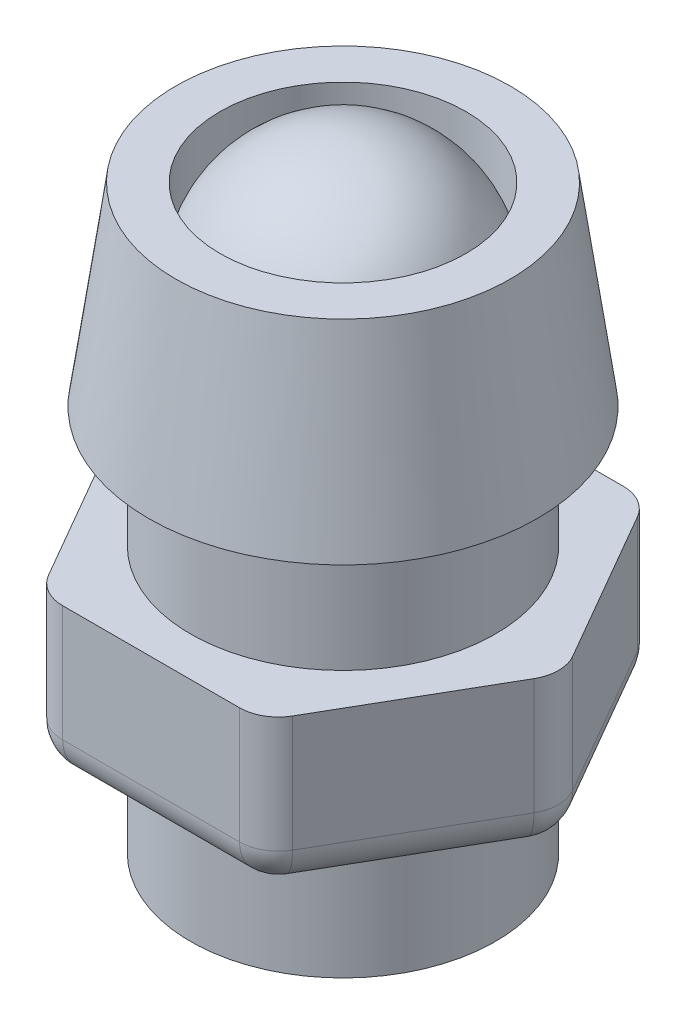
ISO-10303-21;
HEADER;
FILE_DESCRIPTION(('STEP AP214'),'2;1');
FILE_NAME('part.step','',(''),(''),'','','');
FILE_SCHEMA(('AUTOMOTIVE_DESIGN { 1 0 10303 214 1 1 1 1 }'));
ENDSEC;
DATA;
#1=APPLICATION_CONTEXT('core data for automotive mechanical design processes');
#2=APPLICATION_PROTOCOL_DEFINITION('international standard','automotive_design',2000,#1);
#3=PRODUCT_CONTEXT('',#1,'mechanical');
#4=PRODUCT('Part','Part','',(#3));
#5=PRODUCT_RELATED_PRODUCT_CATEGORY('part','',(#4));
#6=PRODUCT_DEFINITION_FORMATION('','',#4);
#7=PRODUCT_DEFINITION_CONTEXT('part definition',#1,'design');
#8=PRODUCT_DEFINITION('design','',#6,#7);
#9=PRODUCT_DEFINITION_SHAPE('','',#8);
#10=(LENGTH_UNIT() NAMED_UNIT(*) SI_UNIT(.MILLI.,.METRE.));
#11=(NAMED_UNIT(*) PLANE_ANGLE_UNIT() SI_UNIT($,.RADIAN.));
#12=(NAMED_UNIT(*) SI_UNIT($,.STERADIAN.) SOLID_ANGLE_UNIT());
#13=UNCERTAINTY_MEASURE_WITH_UNIT(LENGTH_MEASURE(1.E-05),#10,'distance_accuracy_value','');
#14=(GEOMETRIC_REPRESENTATION_CONTEXT(3) GLOBAL_UNCERTAINTY_ASSIGNED_CONTEXT((#13)) GLOBAL_UNIT_ASSIGNED_CONTEXT((#10,
#11,#12)) REPRESENTATION_CONTEXT('',''));
#15=CARTESIAN_POINT('',(0.,0.,0.));
#16=DIRECTION('',(0.,0.,1.));
#17=DIRECTION('',(1.,0.,0.));
#18=AXIS2_PLACEMENT_3D('',#15,#16,#17);
#19=CARTESIAN_POINT('',(0.,12.7,0.));
#20=DIRECTION('',(0.,-1.,0.));
#21=DIRECTION('',(1.,0.,0.));
#22=AXIS2_PLACEMENT_3D('',#19,#20,#21);
#23=SPHERICAL_SURFACE('',#22,3.3);
#24=CARTESIAN_POINT('',(0.,13.5996527107723,0.));
#25=DIRECTION('',(0.,-1.,0.));
#26=DIRECTION('',(0.,0.,-1.));
#27=AXIS2_PLACEMENT_3D('',#24,#25,#26);
#28=CIRCLE('',#27,3.175);
#29=CARTESIAN_POINT('',(0.,13.5996527107723,-3.175));
#30=VERTEX_POINT('',#29);
#31=EDGE_CURVE('E11',#30,#30,#28,.T.);
#32=ORIENTED_EDGE('',*,*,#31,.F.);
#33=EDGE_LOOP('',(#32));
#34=FACE_BOUND('',#33,.T.);
#35=ADVANCED_FACE('F44',(#34),#23,.T.);
#36=CARTESIAN_POINT('',(0.,13.5996527107723,0.));
#37=DIRECTION('',(0.,-1.,0.));
#38=DIRECTION('',(0.,0.,-1.));
#39=AXIS2_PLACEMENT_3D('',#36,#37,#38);
#40=PLANE('',#39);
#41=ORIENTED_EDGE('',*,*,#31,.T.);
#42=EDGE_LOOP('',(#41));
#43=FACE_BOUND('',#42,.T.);
#44=ADVANCED_FACE('F51',(#43),#40,.T.);
#45=CLOSED_SHELL('',(#35,#44));
#46=MANIFOLD_SOLID_BREP('B2',#45);
#47=CARTESIAN_POINT('',(0.,0.,0.));
#48=DIRECTION('',(0.,-1.,0.));
#49=DIRECTION('',(0.,0.,-1.));
#50=AXIS2_PLACEMENT_3D('',#47,#48,#49);
#51=CYLINDRICAL_SURFACE('',#50,3.937);
#52=CARTESIAN_POINT('',(0.,9.99999999999999,0.));
#53=DIRECTION('',(0.,-1.,0.));
#54=DIRECTION('',(0.,0.,-1.));
#55=AXIS2_PLACEMENT_3D('',#52,#53,#54);
#56=CIRCLE('',#55,3.937);
#57=CARTESIAN_POINT('',(0.,9.99999999999999,-3.937));
#58=VERTEX_POINT('',#57);
#59=EDGE_CURVE('E233',#58,#58,#56,.T.);
#60=ORIENTED_EDGE('',*,*,#59,.T.);
#61=EDGE_LOOP('',(#60));
#62=FACE_BOUND('',#61,.T.);
#63=CARTESIAN_POINT('',(0.,6.87499999999999,0.));
#64=DIRECTION('',(0.,-1.,0.));
#65=DIRECTION('',(0.,0.,-1.));
#66=AXIS2_PLACEMENT_3D('',#63,#64,#65);
#67=CIRCLE('',#66,3.937);
#68=CARTESIAN_POINT('',(0.,6.87499999999999,-3.937));
#69=VERTEX_POINT('',#68);
#70=EDGE_CURVE('E211',#69,#69,#67,.F.);
#71=ORIENTED_EDGE('',*,*,#70,.T.);
#72=EDGE_LOOP('',(#71));
#73=FACE_BOUND('',#72,.T.);
#74=ADVANCED_FACE('F71',(#62,#73),#51,.T.);
#75=CARTESIAN_POINT('',(0.,0.,0.));
#76=DIRECTION('',(0.,1.,0.));
#77=DIRECTION('',(0.,0.,1.));
#78=AXIS2_PLACEMENT_3D('',#75,#76,#77);
#79=CYLINDRICAL_SURFACE('',#78,3.175);
#80=CARTESIAN_POINT('',(0.,15.,0.));
#81=DIRECTION('',(0.,1.,0.));
#82=DIRECTION('',(0.,0.,1.));
#83=AXIS2_PLACEMENT_3D('',#80,#81,#82);
#84=CIRCLE('',#83,3.175);
#85=CARTESIAN_POINT('',(0.,15.,3.175));
#86=VERTEX_POINT('',#85);
#87=EDGE_CURVE('E228',#86,#86,#84,.T.);
#88=ORIENTED_EDGE('',*,*,#87,.T.);
#89=EDGE_LOOP('',(#88));
#90=FACE_BOUND('',#89,.T.);
#91=CARTESIAN_POINT('',(0.,6.87499999999999,0.));
#92=DIRECTION('',(0.,-1.,0.));
#93=DIRECTION('',(0.,0.,-1.));
#94=AXIS2_PLACEMENT_3D('',#91,#92,#93);
#95=CIRCLE('',#94,3.175);
#96=CARTESIAN_POINT('',(0.,6.87499999999999,-3.175));
#97=VERTEX_POINT('',#96);
#98=EDGE_CURVE('E223',#97,#97,#95,.F.);
#99=ORIENTED_EDGE('',*,*,#98,.F.);
#100=EDGE_LOOP('',(#99));
#101=FACE_BOUND('',#100,.T.);
#102=ADVANCED_FACE('F451',(#90,#101),#79,.F.);
#103=CARTESIAN_POINT('',(0.,15.,0.));
#104=DIRECTION('',(0.,1.,0.));
#105=DIRECTION('',(0.,0.,1.));
#106=AXIS2_PLACEMENT_3D('',#103,#104,#105);
#107=PLANE('',#106);
#108=ORIENTED_EDGE('',*,*,#87,.F.);
#109=EDGE_LOOP('',(#108));
#110=FACE_BOUND('',#109,.T.);
#111=CARTESIAN_POINT('',(0.,15.,0.));
#112=DIRECTION('',(0.,-1.,0.));
#113=DIRECTION('',(0.,0.,-1.));
#114=AXIS2_PLACEMENT_3D('',#111,#112,#113);
#115=CIRCLE('',#114,4.318);
#116=CARTESIAN_POINT('',(0.,15.,-4.318));
#117=VERTEX_POINT('',#116);
#118=EDGE_CURVE('E239',#117,#117,#115,.T.);
#119=ORIENTED_EDGE('',*,*,#118,.F.);
#120=EDGE_LOOP('',(#119));
#121=FACE_BOUND('',#120,.T.);
#122=ADVANCED_FACE('F459',(#110,#121),#107,.T.);
#123=CARTESIAN_POINT('',(0.,10.,0.));
#124=DIRECTION('',(0.,-1.,0.));
#125=DIRECTION('',(0.,0.,-1.));
#126=AXIS2_PLACEMENT_3D('',#123,#124,#125);
#127=CONICAL_SURFACE('',#126,5.02070417351192,0.139626340159539);
#128=ORIENTED_EDGE('',*,*,#118,.T.);
#129=EDGE_LOOP('',(#128));
#130=FACE_BOUND('',#129,.T.);
#131=CARTESIAN_POINT('',(0.,10.,0.));
#132=DIRECTION('',(0.,-1.,0.));
#133=DIRECTION('',(0.,0.,-1.));
#134=AXIS2_PLACEMENT_3D('',#131,#132,#133);
#135=CIRCLE('',#134,5.02070417351192);
#136=CARTESIAN_POINT('',(0.,10.,-5.02070417351192));
#137=VERTEX_POINT('',#136);
#138=EDGE_CURVE('E236',#137,#137,#135,.T.);
#139=ORIENTED_EDGE('',*,*,#138,.F.);
#140=EDGE_LOOP('',(#139));
#141=FACE_BOUND('',#140,.T.);
#142=ADVANCED_FACE('F468',(#130,#141),#127,.T.);
#143=CARTESIAN_POINT('',(5.02070417351192,9.99999999999999,0.));
#144=DIRECTION('',(0.,-1.,0.));
#145=DIRECTION('',(0.,0.,-1.));
#146=AXIS2_PLACEMENT_3D('',#143,#144,#145);
#147=PLANE('',#146);
#148=ORIENTED_EDGE('',*,*,#138,.T.);
#149=EDGE_LOOP('',(#148));
#150=FACE_BOUND('',#149,.T.);
#151=ORIENTED_EDGE('',*,*,#59,.F.);
#152=EDGE_LOOP('',(#151));
#153=FACE_BOUND('',#152,.T.);
#154=ADVANCED_FACE('F464',(#150,#153),#147,.T.);
#155=CARTESIAN_POINT('',(0.,6.87499999999999,0.));
#156=DIRECTION('',(0.,-1.,0.));
#157=DIRECTION('',(0.,0.,-1.));
#158=AXIS2_PLACEMENT_3D('',#155,#156,#157);
#159=PLANE('',#158);
#160=ORIENTED_EDGE('',*,*,#98,.T.);
#161=EDGE_LOOP('',(#160));
#162=FACE_BOUND('',#161,.T.);
#163=ADVANCED_FACE('F467',(#162),#159,.F.);
#164=CARTESIAN_POINT('',(-2.85961588329622,2.87499999999999,4.953));
#165=DIRECTION('',(0.866025403784439,0.,-0.5));
#166=DIRECTION('',(-0.5,0.,-0.866025403784439));
#167=AXIS2_PLACEMENT_3D('',#164,#165,#166);
#168=PLANE('',#167);
#169=DIRECTION('',(0.,1.,0.));
#170=VECTOR('',#169,1.);
#171=CARTESIAN_POINT('',(-5.43055663199762,2.87499999999999,0.5));
#172=LINE('',#171,#170);
#173=CARTESIAN_POINT('',(-5.43055663199762,6.87499999999999,0.5));
#174=VERTEX_POINT('',#173);
#175=CARTESIAN_POINT('',(-5.43055663199762,3.87499999999999,0.5));
#176=VERTEX_POINT('',#175);
#177=EDGE_CURVE('E268',#174,#176,#172,.F.);
#178=ORIENTED_EDGE('',*,*,#177,.T.);
#179=DIRECTION('',(-0.5,0.,-0.866025403784439));
#180=VECTOR('',#179,1.);
#181=CARTESIAN_POINT('',(-3.14829101789103,3.87499999999999,4.453));
#182=LINE('',#181,#180);
#183=CARTESIAN_POINT('',(-3.14829101789103,3.87499999999999,4.453));
#184=VERTEX_POINT('',#183);
#185=EDGE_CURVE('E296',#176,#184,#182,.F.);
#186=ORIENTED_EDGE('',*,*,#185,.T.);
#187=DIRECTION('',(0.,1.,0.));
#188=VECTOR('',#187,1.);
#189=CARTESIAN_POINT('',(-3.14829101789103,2.87499999999999,4.453));
#190=LINE('',#189,#188);
#191=CARTESIAN_POINT('',(-3.14829101789103,6.87499999999999,4.453));
#192=VERTEX_POINT('',#191);
#193=EDGE_CURVE('E266',#184,#192,#190,.T.);
#194=ORIENTED_EDGE('',*,*,#193,.T.);
#195=DIRECTION('',(-0.5,0.,-0.866025403784439));
#196=VECTOR('',#195,1.);
#197=CARTESIAN_POINT('',(-2.85961588329622,6.87499999999999,4.953));
#198=LINE('',#197,#196);
#199=EDGE_CURVE('E343',#192,#174,#198,.T.);
#200=ORIENTED_EDGE('',*,*,#199,.T.);
#201=EDGE_LOOP('',(#178,#186,#194,#200));
#202=FACE_BOUND('',#201,.T.);
#203=ADVANCED_FACE('F409',(#202),#168,.F.);
#204=CARTESIAN_POINT('',(-5.71923176659243,2.87499999999999,0.));
#205=DIRECTION('',(0.866025403784438,0.,0.5));
#206=DIRECTION('',(0.5,0.,-0.866025403784439));
#207=AXIS2_PLACEMENT_3D('',#204,#205,#206);
#208=PLANE('',#207);
#209=DIRECTION('',(0.,1.,0.));
#210=VECTOR('',#209,1.);
#211=CARTESIAN_POINT('',(-3.14829101789103,2.87499999999999,-4.453));
#212=LINE('',#211,#210);
#213=CARTESIAN_POINT('',(-3.14829101789103,6.87499999999999,-4.453));
#214=VERTEX_POINT('',#213);
#215=CARTESIAN_POINT('',(-3.14829101789103,3.87499999999999,-4.453));
#216=VERTEX_POINT('',#215);
#217=EDGE_CURVE('E263',#214,#216,#212,.F.);
#218=ORIENTED_EDGE('',*,*,#217,.T.);
#219=DIRECTION('',(0.5,0.,-0.866025403784439));
#220=VECTOR('',#219,1.);
#221=CARTESIAN_POINT('',(-5.43055663199762,3.87499999999999,-0.499999999999999));
#222=LINE('',#221,#220);
#223=CARTESIAN_POINT('',(-5.43055663199762,3.87499999999999,-0.5));
#224=VERTEX_POINT('',#223);
#225=EDGE_CURVE('E292',#216,#224,#222,.F.);
#226=ORIENTED_EDGE('',*,*,#225,.T.);
#227=DIRECTION('',(0.,1.,0.));
#228=VECTOR('',#227,1.);
#229=CARTESIAN_POINT('',(-5.43055663199762,2.87499999999999,-0.5));
#230=LINE('',#229,#228);
#231=CARTESIAN_POINT('',(-5.43055663199762,6.87499999999999,-0.5));
#232=VERTEX_POINT('',#231);
#233=EDGE_CURVE('E261',#224,#232,#230,.T.);
#234=ORIENTED_EDGE('',*,*,#233,.T.);
#235=DIRECTION('',(0.5,0.,-0.866025403784439));
#236=VECTOR('',#235,1.);
#237=CARTESIAN_POINT('',(-5.71923176659243,6.87499999999999,0.));
#238=LINE('',#237,#236);
#239=EDGE_CURVE('E348',#232,#214,#238,.T.);
#240=ORIENTED_EDGE('',*,*,#239,.T.);
#241=EDGE_LOOP('',(#218,#226,#234,#240));
#242=FACE_BOUND('',#241,.T.);
#243=ADVANCED_FACE('F394',(#242),#208,.F.);
#244=CARTESIAN_POINT('',(-2.85961588329621,2.87499999999999,-4.953));
#245=DIRECTION('',(0.,0.,1.));
#246=DIRECTION('',(1.,0.,0.));
#247=AXIS2_PLACEMENT_3D('',#244,#245,#246);
#248=PLANE('',#247);
#249=DIRECTION('',(0.,1.,0.));
#250=VECTOR('',#249,1.);
#251=CARTESIAN_POINT('',(2.28226561410659,2.87499999999999,-4.953));
#252=LINE('',#251,#250);
#253=CARTESIAN_POINT('',(2.28226561410659,6.87499999999999,-4.953));
#254=VERTEX_POINT('',#253);
#255=CARTESIAN_POINT('',(2.28226561410659,3.87499999999999,-4.953));
#256=VERTEX_POINT('',#255);
#257=EDGE_CURVE('E259',#254,#256,#252,.F.);
#258=ORIENTED_EDGE('',*,*,#257,.T.);
#259=DIRECTION('',(1.,0.,0.));
#260=VECTOR('',#259,1.);
#261=CARTESIAN_POINT('',(-2.28226561410659,3.87499999999999,-4.953));
#262=LINE('',#261,#260);
#263=CARTESIAN_POINT('',(-2.28226561410659,3.87499999999999,-4.953));
#264=VERTEX_POINT('',#263);
#265=EDGE_CURVE('E42',#256,#264,#262,.F.);
#266=ORIENTED_EDGE('',*,*,#265,.T.);
#267=DIRECTION('',(0.,1.,0.));
#268=VECTOR('',#267,1.);
#269=CARTESIAN_POINT('',(-2.28226561410659,2.87499999999999,-4.953));
#270=LINE('',#269,#268);
#271=CARTESIAN_POINT('',(-2.28226561410659,6.87499999999999,-4.953));
#272=VERTEX_POINT('',#271);
#273=EDGE_CURVE('E257',#264,#272,#270,.T.);
#274=ORIENTED_EDGE('',*,*,#273,.T.);
#275=DIRECTION('',(1.,0.,0.));
#276=VECTOR('',#275,1.);
#277=CARTESIAN_POINT('',(-2.85961588329621,6.87499999999999,-4.953));
#278=LINE('',#277,#276);
#279=EDGE_CURVE('E213',#272,#254,#278,.T.);
#280=ORIENTED_EDGE('',*,*,#279,.T.);
#281=EDGE_LOOP('',(#258,#266,#274,#280));
#282=FACE_BOUND('',#281,.T.);
#283=ADVANCED_FACE('F358',(#282),#248,.F.);
#284=CARTESIAN_POINT('',(2.85961588329622,2.87499999999999,-4.953));
#285=DIRECTION('',(-0.866025403784439,0.,0.5));
#286=DIRECTION('',(0.5,0.,0.866025403784439));
#287=AXIS2_PLACEMENT_3D('',#284,#285,#286);
#288=PLANE('',#287);
#289=DIRECTION('',(0.,1.,0.));
#290=VECTOR('',#289,1.);
#291=CARTESIAN_POINT('',(5.43055663199762,2.87499999999999,-0.499999999999999));
#292=LINE('',#291,#290);
#293=CARTESIAN_POINT('',(5.43055663199762,6.87499999999999,-0.499999999999999));
#294=VERTEX_POINT('',#293);
#295=CARTESIAN_POINT('',(5.43055663199762,3.87499999999999,-0.499999999999999));
#296=VERTEX_POINT('',#295);
#297=EDGE_CURVE('E197',#294,#296,#292,.F.);
#298=ORIENTED_EDGE('',*,*,#297,.T.);
#299=DIRECTION('',(0.5,0.,0.866025403784439));
#300=VECTOR('',#299,1.);
#301=CARTESIAN_POINT('',(3.14829101789103,3.87499999999999,-4.453));
#302=LINE('',#301,#300);
#303=CARTESIAN_POINT('',(3.14829101789103,3.87499999999999,-4.453));
#304=VERTEX_POINT('',#303);
#305=EDGE_CURVE('E95',#296,#304,#302,.F.);
#306=ORIENTED_EDGE('',*,*,#305,.T.);
#307=DIRECTION('',(0.,1.,0.));
#308=VECTOR('',#307,1.);
#309=CARTESIAN_POINT('',(3.14829101789103,2.87499999999999,-4.453));
#310=LINE('',#309,#308);
#311=CARTESIAN_POINT('',(3.14829101789103,6.87499999999999,-4.453));
#312=VERTEX_POINT('',#311);
#313=EDGE_CURVE('E201',#304,#312,#310,.T.);
#314=ORIENTED_EDGE('',*,*,#313,.T.);
#315=DIRECTION('',(0.5,0.,0.866025403784439));
#316=VECTOR('',#315,1.);
#317=CARTESIAN_POINT('',(2.85961588329622,6.87499999999999,-4.953));
#318=LINE('',#317,#316);
#319=EDGE_CURVE('E208',#312,#294,#318,.T.);
#320=ORIENTED_EDGE('',*,*,#319,.T.);
#321=EDGE_LOOP('',(#298,#306,#314,#320));
#322=FACE_BOUND('',#321,.T.);
#323=ADVANCED_FACE('F365',(#322),#288,.F.);
#324=CARTESIAN_POINT('',(5.71923176659243,2.87499999999999,0.));
#325=DIRECTION('',(-0.866025403784438,0.,-0.5));
#326=DIRECTION('',(-0.5,0.,0.866025403784438));
#327=AXIS2_PLACEMENT_3D('',#324,#325,#326);
#328=PLANE('',#327);
#329=DIRECTION('',(0.,1.,0.));
#330=VECTOR('',#329,1.);
#331=CARTESIAN_POINT('',(3.14829101789103,2.87499999999999,4.453));
#332=LINE('',#331,#330);
#333=CARTESIAN_POINT('',(3.14829101789103,6.87499999999999,4.453));
#334=VERTEX_POINT('',#333);
#335=CARTESIAN_POINT('',(3.14829101789103,3.87499999999999,4.453));
#336=VERTEX_POINT('',#335);
#337=EDGE_CURVE('E192',#334,#336,#332,.F.);
#338=ORIENTED_EDGE('',*,*,#337,.T.);
#339=DIRECTION('',(-0.5,0.,0.866025403784438));
#340=VECTOR('',#339,1.);
#341=CARTESIAN_POINT('',(5.43055663199762,3.87499999999999,0.500000000000001));
#342=LINE('',#341,#340);
#343=CARTESIAN_POINT('',(5.43055663199762,3.87499999999999,0.500000000000001));
#344=VERTEX_POINT('',#343);
#345=EDGE_CURVE('E188',#336,#344,#342,.F.);
#346=ORIENTED_EDGE('',*,*,#345,.T.);
#347=DIRECTION('',(0.,1.,0.));
#348=VECTOR('',#347,1.);
#349=CARTESIAN_POINT('',(5.43055663199762,2.87499999999999,0.500000000000001));
#350=LINE('',#349,#348);
#351=CARTESIAN_POINT('',(5.43055663199762,6.87499999999999,0.500000000000001));
#352=VERTEX_POINT('',#351);
#353=EDGE_CURVE('E180',#344,#352,#350,.T.);
#354=ORIENTED_EDGE('',*,*,#353,.T.);
#355=DIRECTION('',(-0.5,0.,0.866025403784438));
#356=VECTOR('',#355,1.);
#357=CARTESIAN_POINT('',(5.71923176659243,6.87499999999999,0.));
#358=LINE('',#357,#356);
#359=EDGE_CURVE('E185',#352,#334,#358,.T.);
#360=ORIENTED_EDGE('',*,*,#359,.T.);
#361=EDGE_LOOP('',(#338,#346,#354,#360));
#362=FACE_BOUND('',#361,.T.);
#363=ADVANCED_FACE('F183',(#362),#328,.F.);
#364=CARTESIAN_POINT('',(2.85961588329622,2.87499999999999,4.953));
#365=DIRECTION('',(0.,0.,-1.));
#366=DIRECTION('',(-1.,0.,0.));
#367=AXIS2_PLACEMENT_3D('',#364,#365,#366);
#368=PLANE('',#367);
#369=DIRECTION('',(0.,1.,0.));
#370=VECTOR('',#369,1.);
#371=CARTESIAN_POINT('',(-2.28226561410659,2.87499999999999,4.953));
#372=LINE('',#371,#370);
#373=CARTESIAN_POINT('',(-2.28226561410659,6.87499999999999,4.953));
#374=VERTEX_POINT('',#373);
#375=CARTESIAN_POINT('',(-2.28226561410659,3.87499999999999,4.953));
#376=VERTEX_POINT('',#375);
#377=EDGE_CURVE('E273',#374,#376,#372,.F.);
#378=ORIENTED_EDGE('',*,*,#377,.T.);
#379=DIRECTION('',(-1.,0.,0.));
#380=VECTOR('',#379,1.);
#381=CARTESIAN_POINT('',(2.28226561410659,3.87499999999999,4.953));
#382=LINE('',#381,#380);
#383=CARTESIAN_POINT('',(2.28226561410659,3.87499999999999,4.953));
#384=VERTEX_POINT('',#383);
#385=EDGE_CURVE('E300',#376,#384,#382,.F.);
#386=ORIENTED_EDGE('',*,*,#385,.T.);
#387=DIRECTION('',(0.,1.,0.));
#388=VECTOR('',#387,1.);
#389=CARTESIAN_POINT('',(2.28226561410659,2.87499999999999,4.953));
#390=LINE('',#389,#388);
#391=CARTESIAN_POINT('',(2.28226561410659,6.87499999999999,4.953));
#392=VERTEX_POINT('',#391);
#393=EDGE_CURVE('E271',#384,#392,#390,.T.);
#394=ORIENTED_EDGE('',*,*,#393,.T.);
#395=DIRECTION('',(-1.,0.,0.));
#396=VECTOR('',#395,1.);
#397=CARTESIAN_POINT('',(2.85961588329622,6.87499999999999,4.953));
#398=LINE('',#397,#396);
#399=EDGE_CURVE('E207',#392,#374,#398,.T.);
#400=ORIENTED_EDGE('',*,*,#399,.T.);
#401=EDGE_LOOP('',(#378,#386,#394,#400));
#402=FACE_BOUND('',#401,.T.);
#403=ADVANCED_FACE('F421',(#402),#368,.F.);
#404=CARTESIAN_POINT('',(0.,2.87499999999999,0.));
#405=DIRECTION('',(0.,-1.,0.));
#406=DIRECTION('',(0.,0.,-1.));
#407=AXIS2_PLACEMENT_3D('',#404,#405,#406);
#408=PLANE('',#407);
#409=DIRECTION('',(-0.5,0.,-0.866025403784439));
#410=VECTOR('',#409,1.);
#411=CARTESIAN_POINT('',(-4.56453122821318,2.87499999999999,0.));
#412=LINE('',#411,#410);
#413=CARTESIAN_POINT('',(-2.28226561410659,2.87499999999999,3.953));
#414=VERTEX_POINT('',#413);
#415=CARTESIAN_POINT('',(-4.56453122821318,2.87499999999999,0.));
#416=VERTEX_POINT('',#415);
#417=EDGE_CURVE('E287',#414,#416,#412,.T.);
#418=ORIENTED_EDGE('',*,*,#417,.T.);
#419=DIRECTION('',(0.5,0.,-0.866025403784439));
#420=VECTOR('',#419,1.);
#421=CARTESIAN_POINT('',(-2.28226561410659,2.87499999999999,-3.953));
#422=LINE('',#421,#420);
#423=CARTESIAN_POINT('',(-2.28226561410659,2.87499999999999,-3.953));
#424=VERTEX_POINT('',#423);
#425=EDGE_CURVE('E289',#416,#424,#422,.T.);
#426=ORIENTED_EDGE('',*,*,#425,.T.);
#427=DIRECTION('',(1.,0.,0.));
#428=VECTOR('',#427,1.);
#429=CARTESIAN_POINT('',(2.28226561410659,2.87499999999999,-3.953));
#430=LINE('',#429,#428);
#431=CARTESIAN_POINT('',(2.28226561410659,2.87499999999999,-3.953));
#432=VERTEX_POINT('',#431);
#433=EDGE_CURVE('E279',#424,#432,#430,.T.);
#434=ORIENTED_EDGE('',*,*,#433,.T.);
#435=DIRECTION('',(0.5,0.,0.866025403784439));
#436=VECTOR('',#435,1.);
#437=CARTESIAN_POINT('',(4.56453122821318,2.87499999999999,0.));
#438=LINE('',#437,#436);
#439=CARTESIAN_POINT('',(4.56453122821318,2.87499999999999,0.));
#440=VERTEX_POINT('',#439);
#441=EDGE_CURVE('E281',#432,#440,#438,.T.);
#442=ORIENTED_EDGE('',*,*,#441,.T.);
#443=DIRECTION('',(-0.5,0.,0.866025403784438));
#444=VECTOR('',#443,1.);
#445=CARTESIAN_POINT('',(2.28226561410659,2.87499999999999,3.953));
#446=LINE('',#445,#444);
#447=CARTESIAN_POINT('',(2.28226561410659,2.87499999999999,3.953));
#448=VERTEX_POINT('',#447);
#449=EDGE_CURVE('E283',#440,#448,#446,.T.);
#450=ORIENTED_EDGE('',*,*,#449,.T.);
#451=DIRECTION('',(-1.,0.,0.));
#452=VECTOR('',#451,1.);
#453=CARTESIAN_POINT('',(-2.28226561410659,2.87499999999999,3.953));
#454=LINE('',#453,#452);
#455=EDGE_CURVE('E285',#448,#414,#454,.T.);
#456=ORIENTED_EDGE('',*,*,#455,.T.);
#457=EDGE_LOOP('',(#418,#426,#434,#442,#450,#456));
#458=FACE_BOUND('',#457,.T.);
#459=CARTESIAN_POINT('',(0.,2.87499999999999,0.));
#460=DIRECTION('',(0.,-1.,0.));
#461=DIRECTION('',(0.,0.,-1.));
#462=AXIS2_PLACEMENT_3D('',#459,#460,#461);
#463=CIRCLE('',#462,3.937);
#464=CARTESIAN_POINT('',(0.,2.87499999999999,-3.937));
#465=VERTEX_POINT('',#464);
#466=EDGE_CURVE('E220',#465,#465,#463,.F.);
#467=ORIENTED_EDGE('',*,*,#466,.T.);
#468=EDGE_LOOP('',(#467));
#469=FACE_BOUND('',#468,.T.);
#470=ADVANCED_FACE('F428',(#458,#469),#408,.T.);
#471=ORIENTED_EDGE('',*,*,#70,.F.);
#472=EDGE_LOOP('',(#471));
#473=FACE_BOUND('',#472,.T.);
#474=ORIENTED_EDGE('',*,*,#359,.F.);
#475=CARTESIAN_POINT('',(4.56453122821318,6.87499999999999,0.));
#476=DIRECTION('',(0.,-1.,0.));
#477=DIRECTION('',(0.,0.,-1.));
#478=AXIS2_PLACEMENT_3D('',#475,#476,#477);
#479=CIRCLE('',#478,1.);
#480=EDGE_CURVE('E195',#352,#294,#479,.F.);
#481=ORIENTED_EDGE('',*,*,#480,.T.);
#482=ORIENTED_EDGE('',*,*,#319,.F.);
#483=CARTESIAN_POINT('',(2.28226561410659,6.87499999999999,-3.953));
#484=DIRECTION('',(0.,-1.,0.));
#485=DIRECTION('',(0.,0.,-1.));
#486=AXIS2_PLACEMENT_3D('',#483,#484,#485);
#487=CIRCLE('',#486,1.);
#488=EDGE_CURVE('E202',#312,#254,#487,.F.);
#489=ORIENTED_EDGE('',*,*,#488,.T.);
#490=ORIENTED_EDGE('',*,*,#279,.F.);
#491=CARTESIAN_POINT('',(-2.28226561410659,6.87499999999999,-3.953));
#492=DIRECTION('',(0.,-1.,0.));
#493=DIRECTION('',(0.,0.,-1.));
#494=AXIS2_PLACEMENT_3D('',#491,#492,#493);
#495=CIRCLE('',#494,1.);
#496=EDGE_CURVE('E252',#272,#214,#495,.F.);
#497=ORIENTED_EDGE('',*,*,#496,.T.);
#498=ORIENTED_EDGE('',*,*,#239,.F.);
#499=CARTESIAN_POINT('',(-4.56453122821318,6.87499999999999,0.));
#500=DIRECTION('',(0.,-1.,0.));
#501=DIRECTION('',(0.,0.,-1.));
#502=AXIS2_PLACEMENT_3D('',#499,#500,#501);
#503=CIRCLE('',#502,1.);
#504=EDGE_CURVE('E250',#232,#174,#503,.F.);
#505=ORIENTED_EDGE('',*,*,#504,.T.);
#506=ORIENTED_EDGE('',*,*,#199,.F.);
#507=CARTESIAN_POINT('',(-2.28226561410659,6.87499999999999,3.953));
#508=DIRECTION('',(0.,-1.,0.));
#509=DIRECTION('',(0.,0.,-1.));
#510=AXIS2_PLACEMENT_3D('',#507,#508,#509);
#511=CIRCLE('',#510,1.);
#512=EDGE_CURVE('E248',#192,#374,#511,.F.);
#513=ORIENTED_EDGE('',*,*,#512,.T.);
#514=ORIENTED_EDGE('',*,*,#399,.F.);
#515=CARTESIAN_POINT('',(2.28226561410659,6.87499999999999,3.953));
#516=DIRECTION('',(0.,-1.,0.));
#517=DIRECTION('',(0.,0.,-1.));
#518=AXIS2_PLACEMENT_3D('',#515,#516,#517);
#519=CIRCLE('',#518,1.);
#520=EDGE_CURVE('E191',#392,#334,#519,.F.);
#521=ORIENTED_EDGE('',*,*,#520,.T.);
#522=EDGE_LOOP('',(#474,#481,#482,#489,#490,#497,#498,#505,#506,#513,#514,#521));
#523=FACE_BOUND('',#522,.T.);
#524=ADVANCED_FACE('F204',(#473,#523),#159,.F.);
#525=ORIENTED_EDGE('',*,*,#466,.F.);
#526=EDGE_LOOP('',(#525));
#527=FACE_BOUND('',#526,.T.);
#528=CARTESIAN_POINT('',(0.,0.,0.));
#529=DIRECTION('',(0.,-1.,0.));
#530=DIRECTION('',(0.,0.,-1.));
#531=AXIS2_PLACEMENT_3D('',#528,#529,#530);
#532=CIRCLE('',#531,3.937);
#533=CARTESIAN_POINT('',(0.,0.,-3.937));
#534=VERTEX_POINT('',#533);
#535=EDGE_CURVE('E227',#534,#534,#532,.T.);
#536=ORIENTED_EDGE('',*,*,#535,.F.);
#537=EDGE_LOOP('',(#536));
#538=FACE_BOUND('',#537,.T.);
#539=ADVANCED_FACE('F435',(#527,#538),#51,.T.);
#540=CARTESIAN_POINT('',(3.937,0.,0.));
#541=DIRECTION('',(0.,-1.,0.));
#542=DIRECTION('',(0.,0.,-1.));
#543=AXIS2_PLACEMENT_3D('',#540,#541,#542);
#544=PLANE('',#543);
#545=CARTESIAN_POINT('',(0.,0.,0.));
#546=DIRECTION('',(0.,1.,0.));
#547=DIRECTION('',(0.,0.,1.));
#548=AXIS2_PLACEMENT_3D('',#545,#546,#547);
#549=CIRCLE('',#548,3.175);
#550=CARTESIAN_POINT('',(0.,0.,3.175));
#551=VERTEX_POINT('',#550);
#552=EDGE_CURVE('E224',#551,#551,#549,.T.);
#553=ORIENTED_EDGE('',*,*,#552,.T.);
#554=EDGE_LOOP('',(#553));
#555=FACE_BOUND('',#554,.T.);
#556=ORIENTED_EDGE('',*,*,#535,.T.);
#557=EDGE_LOOP('',(#556));
#558=FACE_BOUND('',#557,.T.);
#559=ADVANCED_FACE('F438',(#555,#558),#544,.T.);
#560=CARTESIAN_POINT('',(0.,2.87499999999999,0.));
#561=DIRECTION('',(0.,-1.,0.));
#562=DIRECTION('',(0.,0.,-1.));
#563=AXIS2_PLACEMENT_3D('',#560,#561,#562);
#564=CIRCLE('',#563,3.175);
#565=CARTESIAN_POINT('',(0.,2.87499999999999,-3.175));
#566=VERTEX_POINT('',#565);
#567=EDGE_CURVE('E219',#566,#566,#564,.F.);
#568=ORIENTED_EDGE('',*,*,#567,.T.);
#569=EDGE_LOOP('',(#568));
#570=FACE_BOUND('',#569,.T.);
#571=ORIENTED_EDGE('',*,*,#552,.F.);
#572=EDGE_LOOP('',(#571));
#573=FACE_BOUND('',#572,.T.);
#574=ADVANCED_FACE('F443',(#570,#573),#79,.F.);
#575=ORIENTED_EDGE('',*,*,#567,.F.);
#576=EDGE_LOOP('',(#575));
#577=FACE_BOUND('',#576,.T.);
#578=ADVANCED_FACE('F432',(#577),#408,.T.);
#579=CARTESIAN_POINT('',(4.56453122821318,2.87499999999999,0.));
#580=DIRECTION('',(0.,1.,0.));
#581=DIRECTION('',(0.,0.,1.));
#582=AXIS2_PLACEMENT_3D('',#579,#580,#581);
#583=CYLINDRICAL_SURFACE('',#582,1.);
#584=ORIENTED_EDGE('',*,*,#353,.F.);
#585=CARTESIAN_POINT('',(4.56453122821318,3.87499999999999,0.));
#586=DIRECTION('',(0.,1.,0.));
#587=DIRECTION('',(0.,0.,1.));
#588=AXIS2_PLACEMENT_3D('',#585,#586,#587);
#589=CIRCLE('',#588,1.);
#590=EDGE_CURVE('E305',#344,#296,#589,.T.);
#591=ORIENTED_EDGE('',*,*,#590,.T.);
#592=ORIENTED_EDGE('',*,*,#297,.F.);
#593=ORIENTED_EDGE('',*,*,#480,.F.);
#594=EDGE_LOOP('',(#584,#591,#592,#593));
#595=FACE_BOUND('',#594,.T.);
#596=ADVANCED_FACE('F196',(#595),#583,.T.);
#597=CARTESIAN_POINT('',(2.28226561410659,2.87499999999999,-3.953));
#598=DIRECTION('',(0.,1.,0.));
#599=DIRECTION('',(0.,0.,1.));
#600=AXIS2_PLACEMENT_3D('',#597,#598,#599);
#601=CYLINDRICAL_SURFACE('',#600,1.);
#602=ORIENTED_EDGE('',*,*,#313,.F.);
#603=CARTESIAN_POINT('',(2.28226561410659,3.87499999999999,-3.953));
#604=DIRECTION('',(0.,1.,0.));
#605=DIRECTION('',(0.,0.,1.));
#606=AXIS2_PLACEMENT_3D('',#603,#604,#605);
#607=CIRCLE('',#606,1.);
#608=EDGE_CURVE('E80',#304,#256,#607,.T.);
#609=ORIENTED_EDGE('',*,*,#608,.T.);
#610=ORIENTED_EDGE('',*,*,#257,.F.);
#611=ORIENTED_EDGE('',*,*,#488,.F.);
#612=EDGE_LOOP('',(#602,#609,#610,#611));
#613=FACE_BOUND('',#612,.T.);
#614=ADVANCED_FACE('F363',(#613),#601,.T.);
#615=CARTESIAN_POINT('',(-2.28226561410659,2.87499999999999,-3.953));
#616=DIRECTION('',(0.,1.,0.));
#617=DIRECTION('',(0.,0.,1.));
#618=AXIS2_PLACEMENT_3D('',#615,#616,#617);
#619=CYLINDRICAL_SURFACE('',#618,1.);
#620=ORIENTED_EDGE('',*,*,#273,.F.);
#621=CARTESIAN_POINT('',(-2.28226561410659,3.87499999999999,-3.953));
#622=DIRECTION('',(0.,1.,0.));
#623=DIRECTION('',(0.,0.,1.));
#624=AXIS2_PLACEMENT_3D('',#621,#622,#623);
#625=CIRCLE('',#624,1.);
#626=EDGE_CURVE('E276',#264,#216,#625,.T.);
#627=ORIENTED_EDGE('',*,*,#626,.T.);
#628=ORIENTED_EDGE('',*,*,#217,.F.);
#629=ORIENTED_EDGE('',*,*,#496,.F.);
#630=EDGE_LOOP('',(#620,#627,#628,#629));
#631=FACE_BOUND('',#630,.T.);
#632=ADVANCED_FACE('F382',(#631),#619,.T.);
#633=CARTESIAN_POINT('',(-4.56453122821318,2.87499999999999,0.));
#634=DIRECTION('',(0.,1.,0.));
#635=DIRECTION('',(0.,0.,1.));
#636=AXIS2_PLACEMENT_3D('',#633,#634,#635);
#637=CYLINDRICAL_SURFACE('',#636,1.);
#638=ORIENTED_EDGE('',*,*,#233,.F.);
#639=CARTESIAN_POINT('',(-4.56453122821318,3.87499999999999,0.));
#640=DIRECTION('',(0.,1.,0.));
#641=DIRECTION('',(0.,0.,1.));
#642=AXIS2_PLACEMENT_3D('',#639,#640,#641);
#643=CIRCLE('',#642,1.);
#644=EDGE_CURVE('E294',#224,#176,#643,.T.);
#645=ORIENTED_EDGE('',*,*,#644,.T.);
#646=ORIENTED_EDGE('',*,*,#177,.F.);
#647=ORIENTED_EDGE('',*,*,#504,.F.);
#648=EDGE_LOOP('',(#638,#645,#646,#647));
#649=FACE_BOUND('',#648,.T.);
#650=ADVANCED_FACE('F398',(#649),#637,.T.);
#651=CARTESIAN_POINT('',(-2.28226561410659,2.87499999999999,3.953));
#652=DIRECTION('',(0.,1.,0.));
#653=DIRECTION('',(0.,0.,1.));
#654=AXIS2_PLACEMENT_3D('',#651,#652,#653);
#655=CYLINDRICAL_SURFACE('',#654,1.);
#656=ORIENTED_EDGE('',*,*,#193,.F.);
#657=CARTESIAN_POINT('',(-2.28226561410659,3.87499999999999,3.953));
#658=DIRECTION('',(0.,1.,0.));
#659=DIRECTION('',(0.,0.,1.));
#660=AXIS2_PLACEMENT_3D('',#657,#658,#659);
#661=CIRCLE('',#660,1.);
#662=EDGE_CURVE('E298',#184,#376,#661,.T.);
#663=ORIENTED_EDGE('',*,*,#662,.T.);
#664=ORIENTED_EDGE('',*,*,#377,.F.);
#665=ORIENTED_EDGE('',*,*,#512,.F.);
#666=EDGE_LOOP('',(#656,#663,#664,#665));
#667=FACE_BOUND('',#666,.T.);
#668=ADVANCED_FACE('F413',(#667),#655,.T.);
#669=CARTESIAN_POINT('',(2.28226561410659,2.87499999999999,3.953));
#670=DIRECTION('',(0.,1.,0.));
#671=DIRECTION('',(0.,0.,1.));
#672=AXIS2_PLACEMENT_3D('',#669,#670,#671);
#673=CYLINDRICAL_SURFACE('',#672,1.);
#674=ORIENTED_EDGE('',*,*,#393,.F.);
#675=CARTESIAN_POINT('',(2.28226561410659,3.87499999999999,3.953));
#676=DIRECTION('',(0.,1.,0.));
#677=DIRECTION('',(0.,0.,1.));
#678=AXIS2_PLACEMENT_3D('',#675,#676,#677);
#679=CIRCLE('',#678,1.);
#680=EDGE_CURVE('E302',#384,#336,#679,.T.);
#681=ORIENTED_EDGE('',*,*,#680,.T.);
#682=ORIENTED_EDGE('',*,*,#337,.F.);
#683=ORIENTED_EDGE('',*,*,#520,.F.);
#684=EDGE_LOOP('',(#674,#681,#682,#683));
#685=FACE_BOUND('',#684,.T.);
#686=ADVANCED_FACE('F424',(#685),#673,.T.);
#687=CARTESIAN_POINT('',(2.28226561410659,3.87499999999999,3.953));
#688=DIRECTION('',(0.,0.,1.));
#689=DIRECTION('',(1.,0.,0.));
#690=AXIS2_PLACEMENT_3D('',#687,#688,#689);
#691=SPHERICAL_SURFACE('',#690,1.);
#692=CARTESIAN_POINT('',(2.28226561410659,3.87499999999999,3.953));
#693=DIRECTION('',(0.5,0.,-0.866025403784438));
#694=DIRECTION('',(-0.866025403784438,0.,-0.5));
#695=AXIS2_PLACEMENT_3D('',#692,#693,#694);
#696=CIRCLE('',#695,1.);
#697=EDGE_CURVE('E336',#336,#448,#696,.T.);
#698=ORIENTED_EDGE('',*,*,#697,.F.);
#699=ORIENTED_EDGE('',*,*,#680,.F.);
#700=CARTESIAN_POINT('',(2.28226561410659,3.87499999999999,3.953));
#701=DIRECTION('',(-1.,0.,0.));
#702=DIRECTION('',(0.,0.,1.));
#703=AXIS2_PLACEMENT_3D('',#700,#701,#702);
#704=CIRCLE('',#703,1.);
#705=EDGE_CURVE('E75',#448,#384,#704,.T.);
#706=ORIENTED_EDGE('',*,*,#705,.F.);
#707=EDGE_LOOP('',(#698,#699,#706));
#708=FACE_BOUND('',#707,.T.);
#709=ADVANCED_FACE('F73',(#708),#691,.T.);
#710=CARTESIAN_POINT('',(0.,3.87499999999999,3.953));
#711=DIRECTION('',(1.,0.,0.));
#712=DIRECTION('',(0.,0.,-1.));
#713=AXIS2_PLACEMENT_3D('',#710,#711,#712);
#714=CYLINDRICAL_SURFACE('',#713,1.);
#715=ORIENTED_EDGE('',*,*,#705,.T.);
#716=ORIENTED_EDGE('',*,*,#385,.F.);
#717=CARTESIAN_POINT('',(-2.28226561410659,3.87499999999999,3.953));
#718=DIRECTION('',(-1.,0.,0.));
#719=DIRECTION('',(0.,0.,1.));
#720=AXIS2_PLACEMENT_3D('',#717,#718,#719);
#721=CIRCLE('',#720,1.);
#722=EDGE_CURVE('E334',#414,#376,#721,.T.);
#723=ORIENTED_EDGE('',*,*,#722,.F.);
#724=ORIENTED_EDGE('',*,*,#455,.F.);
#725=EDGE_LOOP('',(#715,#716,#723,#724));
#726=FACE_BOUND('',#725,.T.);
#727=ADVANCED_FACE('F418',(#726),#714,.T.);
#728=CARTESIAN_POINT('',(3.42339842115989,3.87499999999999,1.9765));
#729=DIRECTION('',(0.5,0.,-0.866025403784438));
#730=DIRECTION('',(-0.866025403784438,0.,-0.5));
#731=AXIS2_PLACEMENT_3D('',#728,#729,#730);
#732=CYLINDRICAL_SURFACE('',#731,1.);
#733=ORIENTED_EDGE('',*,*,#697,.T.);
#734=ORIENTED_EDGE('',*,*,#449,.F.);
#735=CARTESIAN_POINT('',(4.56453122821318,3.87499999999999,0.));
#736=DIRECTION('',(0.5,0.,-0.866025403784438));
#737=DIRECTION('',(-0.866025403784438,0.,-0.5));
#738=AXIS2_PLACEMENT_3D('',#735,#736,#737);
#739=CIRCLE('',#738,1.);
#740=EDGE_CURVE('E331',#344,#440,#739,.T.);
#741=ORIENTED_EDGE('',*,*,#740,.F.);
#742=ORIENTED_EDGE('',*,*,#345,.F.);
#743=EDGE_LOOP('',(#733,#734,#741,#742));
#744=FACE_BOUND('',#743,.T.);
#745=ADVANCED_FACE('F426',(#744),#732,.T.);
#746=CARTESIAN_POINT('',(-2.28226561410659,3.87499999999999,3.953));
#747=DIRECTION('',(0.,0.,1.));
#748=DIRECTION('',(1.,0.,0.));
#749=AXIS2_PLACEMENT_3D('',#746,#747,#748);
#750=SPHERICAL_SURFACE('',#749,1.);
#751=ORIENTED_EDGE('',*,*,#722,.T.);
#752=ORIENTED_EDGE('',*,*,#662,.F.);
#753=CARTESIAN_POINT('',(-2.28226561410659,3.87499999999999,3.953));
#754=DIRECTION('',(-0.5,0.,-0.866025403784439));
#755=DIRECTION('',(-0.866025403784439,0.,0.5));
#756=AXIS2_PLACEMENT_3D('',#753,#754,#755);
#757=CIRCLE('',#756,1.);
#758=EDGE_CURVE('E328',#414,#184,#757,.T.);
#759=ORIENTED_EDGE('',*,*,#758,.F.);
#760=EDGE_LOOP('',(#751,#752,#759));
#761=FACE_BOUND('',#760,.T.);
#762=ADVANCED_FACE('F416',(#761),#750,.T.);
#763=CARTESIAN_POINT('',(4.56453122821318,3.87499999999999,0.));
#764=DIRECTION('',(0.,0.,1.));
#765=DIRECTION('',(1.,0.,0.));
#766=AXIS2_PLACEMENT_3D('',#763,#764,#765);
#767=SPHERICAL_SURFACE('',#766,1.);
#768=ORIENTED_EDGE('',*,*,#590,.F.);
#769=ORIENTED_EDGE('',*,*,#740,.T.);
#770=CARTESIAN_POINT('',(4.56453122821318,3.87499999999999,0.));
#771=DIRECTION('',(-0.499999999999999,0.,-0.866025403784439));
#772=DIRECTION('',(-0.866025403784439,0.,0.499999999999999));
#773=AXIS2_PLACEMENT_3D('',#770,#771,#772);
#774=CIRCLE('',#773,1.);
#775=EDGE_CURVE('E325',#296,#440,#774,.T.);
#776=ORIENTED_EDGE('',*,*,#775,.F.);
#777=EDGE_LOOP('',(#768,#769,#776));
#778=FACE_BOUND('',#777,.T.);
#779=ADVANCED_FACE('F369',(#778),#767,.T.);
#780=CARTESIAN_POINT('',(-3.42339842115989,3.87499999999999,1.9765));
#781=DIRECTION('',(0.5,0.,0.866025403784439));
#782=DIRECTION('',(0.866025403784439,0.,-0.5));
#783=AXIS2_PLACEMENT_3D('',#780,#781,#782);
#784=CYLINDRICAL_SURFACE('',#783,1.);
#785=ORIENTED_EDGE('',*,*,#758,.T.);
#786=ORIENTED_EDGE('',*,*,#185,.F.);
#787=CARTESIAN_POINT('',(-4.56453122821318,3.87499999999999,0.));
#788=DIRECTION('',(-0.5,0.,-0.866025403784439));
#789=DIRECTION('',(-0.866025403784439,0.,0.5));
#790=AXIS2_PLACEMENT_3D('',#787,#788,#789);
#791=CIRCLE('',#790,1.);
#792=EDGE_CURVE('E322',#416,#176,#791,.T.);
#793=ORIENTED_EDGE('',*,*,#792,.F.);
#794=ORIENTED_EDGE('',*,*,#417,.F.);
#795=EDGE_LOOP('',(#785,#786,#793,#794));
#796=FACE_BOUND('',#795,.T.);
#797=ADVANCED_FACE('F406',(#796),#784,.T.);
#798=CARTESIAN_POINT('',(3.42339842115989,3.87499999999999,-1.9765));
#799=DIRECTION('',(-0.5,0.,-0.866025403784439));
#800=DIRECTION('',(-0.866025403784439,0.,0.5));
#801=AXIS2_PLACEMENT_3D('',#798,#799,#800);
#802=CYLINDRICAL_SURFACE('',#801,1.);
#803=ORIENTED_EDGE('',*,*,#775,.T.);
#804=ORIENTED_EDGE('',*,*,#441,.F.);
#805=CARTESIAN_POINT('',(2.28226561410659,3.87499999999999,-3.953));
#806=DIRECTION('',(-0.5,0.,-0.866025403784438));
#807=DIRECTION('',(-0.866025403784439,0.,0.5));
#808=AXIS2_PLACEMENT_3D('',#805,#806,#807);
#809=CIRCLE('',#808,1.);
#810=EDGE_CURVE('E319',#304,#432,#809,.T.);
#811=ORIENTED_EDGE('',*,*,#810,.F.);
#812=ORIENTED_EDGE('',*,*,#305,.F.);
#813=EDGE_LOOP('',(#803,#804,#811,#812));
#814=FACE_BOUND('',#813,.T.);
#815=ADVANCED_FACE('F372',(#814),#802,.T.);
#816=CARTESIAN_POINT('',(-4.56453122821318,3.87499999999999,0.));
#817=DIRECTION('',(0.,0.,1.));
#818=DIRECTION('',(1.,0.,0.));
#819=AXIS2_PLACEMENT_3D('',#816,#817,#818);
#820=SPHERICAL_SURFACE('',#819,1.);
#821=ORIENTED_EDGE('',*,*,#792,.T.);
#822=ORIENTED_EDGE('',*,*,#644,.F.);
#823=CARTESIAN_POINT('',(-4.56453122821318,3.87499999999999,0.));
#824=DIRECTION('',(0.5,0.,-0.866025403784438));
#825=DIRECTION('',(-0.866025403784439,0.,-0.5));
#826=AXIS2_PLACEMENT_3D('',#823,#824,#825);
#827=CIRCLE('',#826,1.);
#828=EDGE_CURVE('E316',#416,#224,#827,.T.);
#829=ORIENTED_EDGE('',*,*,#828,.F.);
#830=EDGE_LOOP('',(#821,#822,#829));
#831=FACE_BOUND('',#830,.T.);
#832=ADVANCED_FACE('F401',(#831),#820,.T.);
#833=CARTESIAN_POINT('',(2.28226561410659,3.87499999999999,-3.953));
#834=DIRECTION('',(0.,0.,1.));
#835=DIRECTION('',(1.,0.,0.));
#836=AXIS2_PLACEMENT_3D('',#833,#834,#835);
#837=SPHERICAL_SURFACE('',#836,1.);
#838=ORIENTED_EDGE('',*,*,#608,.F.);
#839=ORIENTED_EDGE('',*,*,#810,.T.);
#840=CARTESIAN_POINT('',(2.28226561410659,3.87499999999999,-3.953));
#841=DIRECTION('',(-1.,0.,0.));
#842=DIRECTION('',(0.,0.,1.));
#843=AXIS2_PLACEMENT_3D('',#840,#841,#842);
#844=CIRCLE('',#843,1.);
#845=EDGE_CURVE('E313',#256,#432,#844,.T.);
#846=ORIENTED_EDGE('',*,*,#845,.F.);
#847=EDGE_LOOP('',(#838,#839,#846));
#848=FACE_BOUND('',#847,.T.);
#849=ADVANCED_FACE('F374',(#848),#837,.T.);
#850=CARTESIAN_POINT('',(-3.42339842115988,3.87499999999999,-1.9765));
#851=DIRECTION('',(-0.5,0.,0.866025403784439));
#852=DIRECTION('',(0.866025403784438,0.,0.5));
#853=AXIS2_PLACEMENT_3D('',#850,#851,#852);
#854=CYLINDRICAL_SURFACE('',#853,1.);
#855=ORIENTED_EDGE('',*,*,#828,.T.);
#856=ORIENTED_EDGE('',*,*,#225,.F.);
#857=CARTESIAN_POINT('',(-2.28226561410659,3.87499999999999,-3.953));
#858=DIRECTION('',(0.500000000000001,0.,-0.866025403784438));
#859=DIRECTION('',(-0.866025403784438,0.,-0.500000000000001));
#860=AXIS2_PLACEMENT_3D('',#857,#858,#859);
#861=CIRCLE('',#860,1.);
#862=EDGE_CURVE('E311',#424,#216,#861,.T.);
#863=ORIENTED_EDGE('',*,*,#862,.F.);
#864=ORIENTED_EDGE('',*,*,#425,.F.);
#865=EDGE_LOOP('',(#855,#856,#863,#864));
#866=FACE_BOUND('',#865,.T.);
#867=ADVANCED_FACE('F390',(#866),#854,.T.);
#868=CARTESIAN_POINT('',(0.,3.87499999999999,-3.953));
#869=DIRECTION('',(-1.,0.,0.));
#870=DIRECTION('',(0.,0.,1.));
#871=AXIS2_PLACEMENT_3D('',#868,#869,#870);
#872=CYLINDRICAL_SURFACE('',#871,1.);
#873=ORIENTED_EDGE('',*,*,#845,.T.);
#874=ORIENTED_EDGE('',*,*,#433,.F.);
#875=CARTESIAN_POINT('',(-2.28226561410659,3.87499999999999,-3.953));
#876=DIRECTION('',(-1.,0.,0.));
#877=DIRECTION('',(0.,0.,1.));
#878=AXIS2_PLACEMENT_3D('',#875,#876,#877);
#879=CIRCLE('',#878,1.);
#880=EDGE_CURVE('E309',#264,#424,#879,.T.);
#881=ORIENTED_EDGE('',*,*,#880,.F.);
#882=ORIENTED_EDGE('',*,*,#265,.F.);
#883=EDGE_LOOP('',(#873,#874,#881,#882));
#884=FACE_BOUND('',#883,.T.);
#885=ADVANCED_FACE('F379',(#884),#872,.T.);
#886=CARTESIAN_POINT('',(-2.28226561410659,3.87499999999999,-3.953));
#887=DIRECTION('',(0.,0.,1.));
#888=DIRECTION('',(1.,0.,0.));
#889=AXIS2_PLACEMENT_3D('',#886,#887,#888);
#890=SPHERICAL_SURFACE('',#889,1.);
#891=ORIENTED_EDGE('',*,*,#862,.T.);
#892=ORIENTED_EDGE('',*,*,#626,.F.);
#893=ORIENTED_EDGE('',*,*,#880,.T.);
#894=EDGE_LOOP('',(#891,#892,#893));
#895=FACE_BOUND('',#894,.T.);
#896=ADVANCED_FACE('F385',(#895),#890,.T.);
#897=CLOSED_SHELL('',(#74,#102,#122,#142,#154,#163,#203,#243,#283,#323,#363,#403,#470,#524,#539,
#559,#574,#578,#596,#614,#632,#650,#668,#686,#709,#727,#745,#762,#779,#797,#815,#832,#849,#867,
#885,#896));
#898=MANIFOLD_SOLID_BREP('B6',#897);
#899=ADVANCED_BREP_SHAPE_REPRESENTATION('',(#18,#46,#898),#14);
#900=SHAPE_DEFINITION_REPRESENTATION(#9,#899);
ENDSEC;
END-ISO-10303-21;
